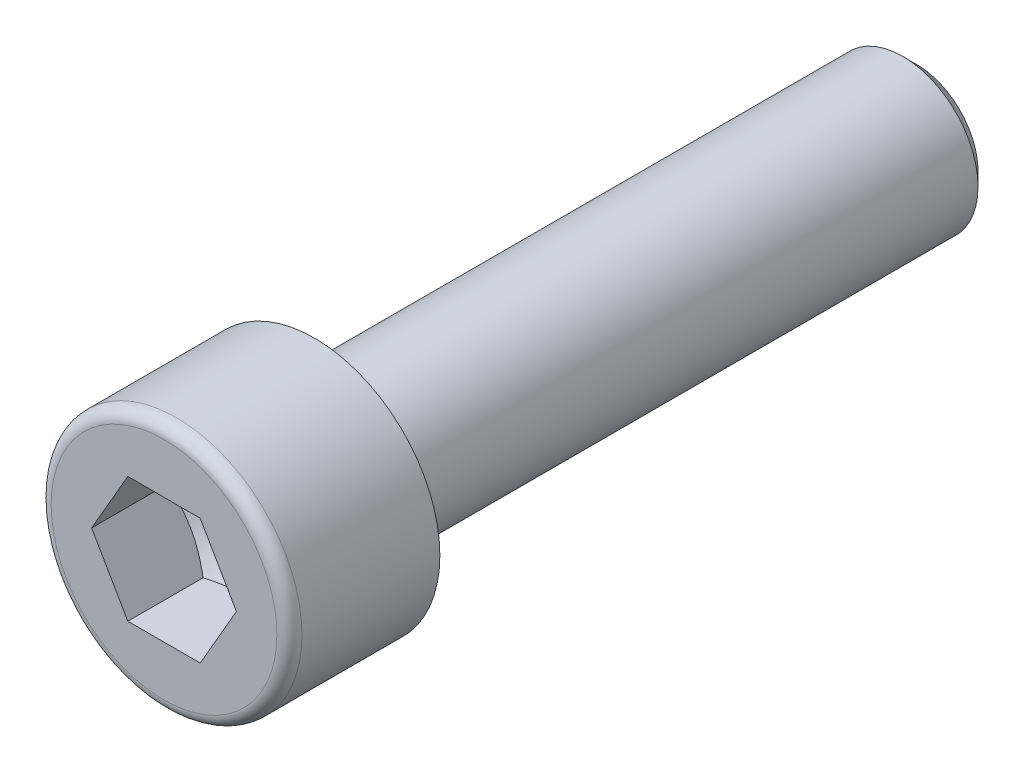
ISO-10303-21;
HEADER;
FILE_DESCRIPTION(('STEP AP214'),'2;1');
FILE_NAME('part.step','',(''),(''),'','','');
FILE_SCHEMA(('AUTOMOTIVE_DESIGN { 1 0 10303 214 1 1 1 1 }'));
ENDSEC;
DATA;
#1=APPLICATION_CONTEXT('core data for automotive mechanical design processes');
#2=APPLICATION_PROTOCOL_DEFINITION('international standard','automotive_design',2000,#1);
#3=PRODUCT_CONTEXT('',#1,'mechanical');
#4=PRODUCT('Part','Part','',(#3));
#5=PRODUCT_RELATED_PRODUCT_CATEGORY('part','',(#4));
#6=PRODUCT_DEFINITION_FORMATION('','',#4);
#7=PRODUCT_DEFINITION_CONTEXT('part definition',#1,'design');
#8=PRODUCT_DEFINITION('design','',#6,#7);
#9=PRODUCT_DEFINITION_SHAPE('','',#8);
#10=(LENGTH_UNIT() NAMED_UNIT(*) SI_UNIT(.MILLI.,.METRE.));
#11=(NAMED_UNIT(*) PLANE_ANGLE_UNIT() SI_UNIT($,.RADIAN.));
#12=(NAMED_UNIT(*) SI_UNIT($,.STERADIAN.) SOLID_ANGLE_UNIT());
#13=UNCERTAINTY_MEASURE_WITH_UNIT(LENGTH_MEASURE(1.E-05),#10,'distance_accuracy_value','');
#14=(GEOMETRIC_REPRESENTATION_CONTEXT(3) GLOBAL_UNCERTAINTY_ASSIGNED_CONTEXT((#13)) GLOBAL_UNIT_ASSIGNED_CONTEXT((#10,
#11,#12)) REPRESENTATION_CONTEXT('',''));
#15=CARTESIAN_POINT('',(0.,0.,0.));
#16=DIRECTION('',(0.,0.,1.));
#17=DIRECTION('',(1.,0.,0.));
#18=AXIS2_PLACEMENT_3D('',#15,#16,#17);
#19=CARTESIAN_POINT('',(0.,0.,0.));
#20=DIRECTION('',(0.,0.,1.));
#21=DIRECTION('',(1.,0.,0.));
#22=AXIS2_PLACEMENT_3D('',#19,#20,#21);
#23=PLANE('',#22);
#24=CARTESIAN_POINT('',(0.,0.,0.));
#25=DIRECTION('',(0.,0.,1.));
#26=DIRECTION('',(1.,0.,0.));
#27=AXIS2_PLACEMENT_3D('',#24,#25,#26);
#28=CIRCLE('',#27,5.);
#29=CARTESIAN_POINT('',(5.,0.,0.));
#30=VERTEX_POINT('',#29);
#31=EDGE_CURVE('E144',#30,#30,#28,.T.);
#32=ORIENTED_EDGE('',*,*,#31,.F.);
#33=EDGE_LOOP('',(#32));
#34=FACE_BOUND('',#33,.T.);
#35=CARTESIAN_POINT('',(0.,0.,0.));
#36=DIRECTION('',(0.,0.,1.));
#37=DIRECTION('',(1.,0.,0.));
#38=AXIS2_PLACEMENT_3D('',#35,#36,#37);
#39=CIRCLE('',#38,3.);
#40=CARTESIAN_POINT('',(3.,0.,0.));
#41=VERTEX_POINT('',#40);
#42=EDGE_CURVE('E149',#41,#41,#39,.F.);
#43=ORIENTED_EDGE('',*,*,#42,.F.);
#44=EDGE_LOOP('',(#43));
#45=FACE_BOUND('',#44,.T.);
#46=ADVANCED_FACE('F41',(#34,#45),#23,.F.);
#47=CARTESIAN_POINT('',(0.,4.5,6.));
#48=DIRECTION('',(0.,0.,-1.));
#49=DIRECTION('',(-1.,0.,0.));
#50=AXIS2_PLACEMENT_3D('',#47,#48,#49);
#51=PLANE('',#50);
#52=CARTESIAN_POINT('',(0.,0.,6.));
#53=DIRECTION('',(0.,0.,-1.));
#54=DIRECTION('',(-1.,0.,0.));
#55=AXIS2_PLACEMENT_3D('',#52,#53,#54);
#56=CIRCLE('',#55,4.5);
#57=CARTESIAN_POINT('',(-4.5,0.,6.));
#58=VERTEX_POINT('',#57);
#59=EDGE_CURVE('E49',#58,#58,#56,.F.);
#60=ORIENTED_EDGE('',*,*,#59,.T.);
#61=EDGE_LOOP('',(#60));
#62=FACE_BOUND('',#61,.T.);
#63=DIRECTION('',(0.5,-0.866025403784439,0.));
#64=VECTOR('',#63,1.);
#65=CARTESIAN_POINT('',(1.443375,2.49999883437473,6.));
#66=LINE('',#65,#64);
#67=CARTESIAN_POINT('',(1.443375,2.49999883437473,6.));
#68=VERTEX_POINT('',#67);
#69=CARTESIAN_POINT('',(2.88675,0.,6.));
#70=VERTEX_POINT('',#69);
#71=EDGE_CURVE('E56',#68,#70,#66,.T.);
#72=ORIENTED_EDGE('',*,*,#71,.T.);
#73=DIRECTION('',(-0.5,-0.866025403784439,0.));
#74=VECTOR('',#73,1.);
#75=CARTESIAN_POINT('',(2.88675,0.,6.));
#76=LINE('',#75,#74);
#77=CARTESIAN_POINT('',(1.443375,-2.49999883437473,6.));
#78=VERTEX_POINT('',#77);
#79=EDGE_CURVE('E173',#70,#78,#76,.T.);
#80=ORIENTED_EDGE('',*,*,#79,.T.);
#81=DIRECTION('',(-1.,0.,0.));
#82=VECTOR('',#81,1.);
#83=CARTESIAN_POINT('',(1.443375,-2.49999883437473,6.));
#84=LINE('',#83,#82);
#85=CARTESIAN_POINT('',(-1.443375,-2.49999883437473,6.));
#86=VERTEX_POINT('',#85);
#87=EDGE_CURVE('E269',#78,#86,#84,.T.);
#88=ORIENTED_EDGE('',*,*,#87,.T.);
#89=DIRECTION('',(-0.5,0.866025403784439,0.));
#90=VECTOR('',#89,1.);
#91=CARTESIAN_POINT('',(-1.443375,-2.49999883437473,6.));
#92=LINE('',#91,#90);
#93=CARTESIAN_POINT('',(-2.88675,0.,6.));
#94=VERTEX_POINT('',#93);
#95=EDGE_CURVE('E273',#86,#94,#92,.T.);
#96=ORIENTED_EDGE('',*,*,#95,.T.);
#97=DIRECTION('',(0.5,0.866025403784439,0.));
#98=VECTOR('',#97,1.);
#99=CARTESIAN_POINT('',(-2.88675,0.,6.));
#100=LINE('',#99,#98);
#101=CARTESIAN_POINT('',(-1.443375,2.49999883437473,6.));
#102=VERTEX_POINT('',#101);
#103=EDGE_CURVE('E128',#94,#102,#100,.T.);
#104=ORIENTED_EDGE('',*,*,#103,.T.);
#105=DIRECTION('',(1.,0.,0.));
#106=VECTOR('',#105,1.);
#107=CARTESIAN_POINT('',(-1.443375,2.49999883437473,6.));
#108=LINE('',#107,#106);
#109=EDGE_CURVE('E120',#102,#68,#108,.T.);
#110=ORIENTED_EDGE('',*,*,#109,.T.);
#111=EDGE_LOOP('',(#72,#80,#88,#96,#104,#110));
#112=FACE_BOUND('',#111,.T.);
#113=ADVANCED_FACE('F228',(#62,#112),#51,.F.);
#114=CARTESIAN_POINT('',(0.,0.,6.));
#115=DIRECTION('',(0.,0.,1.));
#116=DIRECTION('',(1.,0.,0.));
#117=AXIS2_PLACEMENT_3D('',#114,#115,#116);
#118=CYLINDRICAL_SURFACE('',#117,5.);
#119=CARTESIAN_POINT('',(0.,0.,5.5));
#120=DIRECTION('',(0.,0.,-1.));
#121=DIRECTION('',(-1.,0.,0.));
#122=AXIS2_PLACEMENT_3D('',#119,#120,#121);
#123=CIRCLE('',#122,5.);
#124=CARTESIAN_POINT('',(-5.,0.,5.5));
#125=VERTEX_POINT('',#124);
#126=EDGE_CURVE('E12',#125,#125,#123,.T.);
#127=ORIENTED_EDGE('',*,*,#126,.T.);
#128=EDGE_LOOP('',(#127));
#129=FACE_BOUND('',#128,.T.);
#130=ORIENTED_EDGE('',*,*,#31,.T.);
#131=EDGE_LOOP('',(#130));
#132=FACE_BOUND('',#131,.T.);
#133=ADVANCED_FACE('F226',(#129,#132),#118,.T.);
#134=CARTESIAN_POINT('',(1.443375,2.49999883437473,1.33333411041685));
#135=DIRECTION('',(-0.866025403784439,-0.5,0.));
#136=DIRECTION('',(-0.5,0.866025403784438,0.));
#137=AXIS2_PLACEMENT_3D('',#134,#135,#136);
#138=PLANE('',#137);
#139=DIRECTION('',(0.,0.,1.));
#140=VECTOR('',#139,1.);
#141=CARTESIAN_POINT('',(2.88675,0.,1.33333411041685));
#142=LINE('',#141,#140);
#143=CARTESIAN_POINT('',(2.88675,0.,3.));
#144=VERTEX_POINT('',#143);
#145=EDGE_CURVE('E141',#144,#70,#142,.T.);
#146=ORIENTED_EDGE('',*,*,#145,.T.);
#147=ORIENTED_EDGE('',*,*,#71,.F.);
#148=DIRECTION('',(0.,0.,1.));
#149=VECTOR('',#148,1.);
#150=CARTESIAN_POINT('',(1.443375,2.49999883437473,1.33333411041685));
#151=LINE('',#150,#149);
#152=CARTESIAN_POINT('',(1.443375,2.49999883437473,3.));
#153=VERTEX_POINT('',#152);
#154=EDGE_CURVE('E113',#153,#68,#151,.T.);
#155=ORIENTED_EDGE('',*,*,#154,.F.);
#156=CARTESIAN_POINT('',(2.88675115470054,-2.E-06,3.00000066666707));
#157=CARTESIAN_POINT('',(2.82332354535897,0.109857841982227,2.96337006039726));
#158=CARTESIAN_POINT('',(2.75934842983882,0.220665992483223,2.93005643273496));
#159=CARTESIAN_POINT('',(2.63029051087885,0.444200865240994,2.87190847700775));
#160=CARTESIAN_POINT('',(2.56520541506427,0.556931558007335,2.84709471727335));
#161=CARTESIAN_POINT('',(2.4358417909861,0.78099592756197,2.8084702850323));
#162=CARTESIAN_POINT('',(2.37158316147789,0.892295138694932,2.79440251599447));
#163=CARTESIAN_POINT('',(2.24276369983448,1.11541699126498,2.77761163079658));
#164=CARTESIAN_POINT('',(2.17820333560637,1.22723882226323,2.77487460704407));
#165=CARTESIAN_POINT('',(2.05757906871724,1.43616618114094,2.7805828840092));
#166=CARTESIAN_POINT('',(2.00149706603362,1.53330305917919,2.78762661346734));
#167=CARTESIAN_POINT('',(1.88969841687931,1.72694399973201,2.8099466525033));
#168=CARTESIAN_POINT('',(1.83398215680598,1.82344739298676,2.82523057920943));
#169=CARTESIAN_POINT('',(1.72195318911858,2.01748725694082,2.86343746342627));
#170=CARTESIAN_POINT('',(1.66565465323697,2.1149991814795,2.88652230296935));
#171=CARTESIAN_POINT('',(1.55389703460282,2.30856905508676,2.93891513912548));
#172=CARTESIAN_POINT('',(1.49843652119396,2.40462948212476,2.96821083329068));
#173=CARTESIAN_POINT('',(1.44337384529946,2.50000083437473,3.00000066666707));
#174=B_SPLINE_CURVE_WITH_KNOTS('',3,(#156,#157,#158,#159,#160,#161,#162,#163,#164,#165,#166,
#167,#168,#169,#170,#171,#172,#173),.UNSPECIFIED.,.F.,.F.,(4,2,2,2,2,2,2,2,4),(0.,
0.396269987805477,0.793492221888839,1.1808844206854,1.56780098500208,1.90463546712439,
2.24178184973835,2.58640455505215,2.93035090593904),.UNSPECIFIED.);
#175=EDGE_CURVE('E105',#144,#153,#174,.T.);
#176=ORIENTED_EDGE('',*,*,#175,.F.);
#177=EDGE_LOOP('',(#146,#147,#155,#176));
#178=FACE_BOUND('',#177,.T.);
#179=ADVANCED_FACE('F114',(#178),#138,.T.);
#180=CARTESIAN_POINT('',(2.88675,0.,1.33333411041685));
#181=DIRECTION('',(-0.866025403784439,0.5,0.));
#182=DIRECTION('',(0.5,0.866025403784439,0.));
#183=AXIS2_PLACEMENT_3D('',#180,#181,#182);
#184=PLANE('',#183);
#185=DIRECTION('',(0.,0.,1.));
#186=VECTOR('',#185,1.);
#187=CARTESIAN_POINT('',(1.443375,-2.49999883437473,1.33333411041685));
#188=LINE('',#187,#186);
#189=CARTESIAN_POINT('',(1.443375,-2.49999883437473,3.));
#190=VERTEX_POINT('',#189);
#191=EDGE_CURVE('E138',#190,#78,#188,.T.);
#192=ORIENTED_EDGE('',*,*,#191,.T.);
#193=ORIENTED_EDGE('',*,*,#79,.F.);
#194=ORIENTED_EDGE('',*,*,#145,.F.);
#195=CARTESIAN_POINT('',(1.44337384529946,-2.50000083437473,3.00000066666707));
#196=CARTESIAN_POINT('',(1.50680145464103,-2.3901409923925,2.96337006039726));
#197=CARTESIAN_POINT('',(1.57077657016118,-2.27933284189151,2.93005643273496));
#198=CARTESIAN_POINT('',(1.69983448912115,-2.05579796913373,2.87190847700775));
#199=CARTESIAN_POINT('',(1.76491958493573,-1.94306727636739,2.84709471727335));
#200=CARTESIAN_POINT('',(1.8942832090139,-1.71900290681276,2.8084702850323));
#201=CARTESIAN_POINT('',(1.95854183852211,-1.6077036956798,2.79440251599447));
#202=CARTESIAN_POINT('',(2.08736130016552,-1.38458184310974,2.77761163079658));
#203=CARTESIAN_POINT('',(2.15192166439363,-1.2727600121115,2.77487460704408));
#204=CARTESIAN_POINT('',(2.27254593128276,-1.06383265323379,2.7805828840092));
#205=CARTESIAN_POINT('',(2.32862793396638,-0.966695775195541,2.78762661346734));
#206=CARTESIAN_POINT('',(2.44042658312069,-0.773054834642715,2.8099466525033));
#207=CARTESIAN_POINT('',(2.49614284319403,-0.676551441387972,2.82523057920943));
#208=CARTESIAN_POINT('',(2.60817181088142,-0.482511577433911,2.86343746342627));
#209=CARTESIAN_POINT('',(2.66447034676303,-0.384999652895224,2.88652230296935));
#210=CARTESIAN_POINT('',(2.77622796539718,-0.191429779287974,2.93891513912548));
#211=CARTESIAN_POINT('',(2.83168847880604,-0.0953693522499732,2.96821083329068));
#212=CARTESIAN_POINT('',(2.88675115470054,2.00000000025213E-06,3.00000066666707));
#213=B_SPLINE_CURVE_WITH_KNOTS('',3,(#195,#196,#197,#198,#199,#200,#201,#202,#203,#204,#205,
#206,#207,#208,#209,#210,#211,#212),.UNSPECIFIED.,.F.,.F.,(4,2,2,2,2,2,2,2,4),(0.,
0.396269987805478,0.79349222188884,1.1808844206854,1.56780098500208,1.90463546712439,
2.24178184973836,2.58640455505215,2.93035090593904),.UNSPECIFIED.);
#214=EDGE_CURVE('E109',#190,#144,#213,.T.);
#215=ORIENTED_EDGE('',*,*,#214,.F.);
#216=EDGE_LOOP('',(#192,#193,#194,#215));
#217=FACE_BOUND('',#216,.T.);
#218=ADVANCED_FACE('F217',(#217),#184,.T.);
#219=CARTESIAN_POINT('',(1.443375,-2.49999883437473,1.33333411041685));
#220=DIRECTION('',(0.,1.,0.));
#221=DIRECTION('',(1.,0.,0.));
#222=AXIS2_PLACEMENT_3D('',#219,#220,#221);
#223=PLANE('',#222);
#224=DIRECTION('',(0.,0.,1.));
#225=VECTOR('',#224,1.);
#226=CARTESIAN_POINT('',(-1.443375,-2.49999883437473,1.33333411041685));
#227=LINE('',#226,#225);
#228=CARTESIAN_POINT('',(-1.443375,-2.49999883437473,3.));
#229=VERTEX_POINT('',#228);
#230=EDGE_CURVE('E135',#229,#86,#227,.T.);
#231=ORIENTED_EDGE('',*,*,#230,.T.);
#232=ORIENTED_EDGE('',*,*,#87,.F.);
#233=ORIENTED_EDGE('',*,*,#191,.F.);
#234=CARTESIAN_POINT('',(-3.73786106214979,-2.49999883437473,3.92958778907324));
#235=CARTESIAN_POINT('',(-3.62990250335969,-2.49999883437473,3.87779335774325));
#236=CARTESIAN_POINT('',(-3.52168094276801,-2.49999883437473,3.82653690477121));
#237=CARTESIAN_POINT('',(-3.30457164494513,-2.49999883437473,3.72540514162743));
#238=CARTESIAN_POINT('',(-3.19568379207403,-2.49999883437473,3.67553008001432));
#239=CARTESIAN_POINT('',(-2.9764774054262,-2.49999883437473,3.57718765766728));
#240=CARTESIAN_POINT('',(-2.86615419981139,-2.49999883437473,3.52873067133896));
#241=CARTESIAN_POINT('',(-2.64458202847932,-2.49999883437473,3.4339896311619));
#242=CARTESIAN_POINT('',(-2.53333311125245,-2.49999883437473,3.38770546433014));
#243=CARTESIAN_POINT('',(-2.30680205819545,-2.49999883437473,3.2967100755852));
#244=CARTESIAN_POINT('',(-2.19149052050016,-2.49999883437473,3.2520716190807));
#245=CARTESIAN_POINT('',(-1.95947266398433,-2.49999883437473,3.1665059843482));
#246=CARTESIAN_POINT('',(-1.84276618516189,-2.49999883437473,3.12557923657333));
#247=CARTESIAN_POINT('',(-1.60804233924781,-2.49999883437473,3.04860739009266));
#248=CARTESIAN_POINT('',(-1.49002871456052,-2.49999883437473,3.01255100191558));
#249=CARTESIAN_POINT('',(-1.25231014409633,-2.49999883437473,2.94655294839667));
#250=CARTESIAN_POINT('',(-1.13260562628878,-2.49999883437473,2.91660976441946));
#251=CARTESIAN_POINT('',(-0.891754624847682,-2.49999883437473,2.86443431611274));
#252=CARTESIAN_POINT('',(-0.770611640017906,-2.49999883437473,2.84218621451804));
#253=CARTESIAN_POINT('',(-0.526970339246118,-2.49999883437473,2.8068577746921));
#254=CARTESIAN_POINT('',(-0.404472115461951,-2.49999883437473,2.79377681692952));
#255=CARTESIAN_POINT('',(-0.160266323051493,-2.49999883437473,2.7779963214066));
#256=CARTESIAN_POINT('',(-0.0385668667227562,-2.49999883437473,2.77517427588141));
#257=CARTESIAN_POINT('',(0.204641816788917,-2.49999883437473,2.77983589012324));
#258=CARTESIAN_POINT('',(0.326151031726512,-2.49999883437473,2.78732018801759));
#259=CARTESIAN_POINT('',(0.536550258909014,-2.49999883437473,2.80869871352845));
#260=CARTESIAN_POINT('',(0.62567290534766,-2.49999883437473,2.82040889034712));
#261=CARTESIAN_POINT('',(0.80317291802574,-2.49999883437473,2.84856827951529));
#262=CARTESIAN_POINT('',(0.89155015258231,-2.49999883437473,2.86501831186796));
#263=CARTESIAN_POINT('',(1.15551819105506,-2.49999883437473,2.920608175745));
#264=CARTESIAN_POINT('',(1.32980784141715,-2.49999883437473,2.96597208143992));
#265=CARTESIAN_POINT('',(1.59042319619559,-2.49999883437473,3.04347409361569));
#266=CARTESIAN_POINT('',(1.6781227038712,-2.49999883437473,3.07124565241289));
#267=CARTESIAN_POINT('',(1.85261386594625,-2.49999883437473,3.12935698644029));
#268=CARTESIAN_POINT('',(1.93940604944137,-2.49999883437473,3.15969515890171));
#269=CARTESIAN_POINT('',(2.11219208096506,-2.49999883437473,3.2225001255257));
#270=CARTESIAN_POINT('',(2.19818607085344,-2.49999883437473,3.25496653284332));
#271=CARTESIAN_POINT('',(2.36949689943691,-2.49999883437473,3.32167630023758));
#272=CARTESIAN_POINT('',(2.4548136208992,-2.49999883437473,3.35591996053755));
#273=CARTESIAN_POINT('',(2.6725866434786,-2.49999883437473,3.44552247380957));
#274=CARTESIAN_POINT('',(2.80460719164756,-2.49999883437473,3.50193903020824));
#275=CARTESIAN_POINT('',(3.06745887456859,-2.49999883437473,3.61748626069377));
#276=CARTESIAN_POINT('',(3.19828991933625,-2.49999883437473,3.6766171381022));
#277=CARTESIAN_POINT('',(3.4590085358823,-2.49999883437473,3.79697662160321));
#278=CARTESIAN_POINT('',(3.58889593921384,-2.49999883437473,3.85820559158554));
#279=CARTESIAN_POINT('',(3.84788850349047,-2.49999883437473,3.98229871528446));
#280=CARTESIAN_POINT('',(3.97699364696087,-2.49999883437473,4.04516290536492));
#281=CARTESIAN_POINT('',(4.36366797006391,-2.49999883437473,4.23583166126771));
#282=CARTESIAN_POINT('',(4.62028446759073,-2.49999883437473,4.36556642178983));
#283=CARTESIAN_POINT('',(5.13176042686128,-2.49999883437473,4.62835386929467));
#284=CARTESIAN_POINT('',(5.38662010673858,-2.49999883437473,4.76140613453321));
#285=CARTESIAN_POINT('',(5.87112459117811,-2.49999883437473,5.01714634418064));
#286=CARTESIAN_POINT('',(6.10087887005075,-2.49999883437473,5.13962722061171));
#287=CARTESIAN_POINT('',(6.55964844430519,-2.49999883437473,5.38598343470431));
#288=CARTESIAN_POINT('',(6.78866371193351,-2.49999883437473,5.50985882397014));
#289=CARTESIAN_POINT('',(7.2455430452267,-2.49999883437473,5.75833902928913));
#290=CARTESIAN_POINT('',(7.47340855738404,-2.49999883437473,5.88294118863516));
#291=CARTESIAN_POINT('',(7.9286788902648,-2.49999883437473,6.13295649095833));
#292=CARTESIAN_POINT('',(8.156083734473,-2.49999883437473,6.25836959115399));
#293=CARTESIAN_POINT('',(8.38332307978598,-2.49999883437473,6.38407993098458));
#294=B_SPLINE_CURVE_WITH_KNOTS('',3,(#234,#235,#236,#237,#238,#239,#240,#241,#242,#243,#244,
#245,#246,#247,#248,#249,#250,#251,#252,#253,#254,#255,#256,#257,#258,#259,#260,#261,#262,#263,
#264,#265,#266,#267,#268,#269,#270,#271,#272,#273,#274,#275,#276,#277,#278,#279,#280,#281,#282,
#283,#284,#285,#286,#287,#288,#289,#290,#291,#292,#293),.UNSPECIFIED.,.F.,.F.,(4,2,2,2,2,2,2,2,
2,2,2,2,2,2,2,2,2,2,2,2,2,2,2,2,2,2,2,2,2,4),(0.,0.359225681612437,0.718515585501186,
1.07998495471943,1.44143550726446,1.81233642992121,2.18328031172541,2.553349025072,
2.92332569419794,3.29253631826214,3.66172198803058,4.02648423639168,4.39126907037958,
4.66080188357842,4.93038135444365,5.4699536049164,5.74590907322745,6.02169347043866,
6.29742787713709,6.57320901498075,7.00387400010299,7.43457129784687,7.86534367692857,
8.29612564369277,9.15872160396268,10.0212084586034,10.8022892260896,11.5833989933082,
12.3625220011586,13.1416042361018),.UNSPECIFIED.);
#295=EDGE_CURVE('E206',#229,#190,#294,.T.);
#296=ORIENTED_EDGE('',*,*,#295,.F.);
#297=EDGE_LOOP('',(#231,#232,#233,#296));
#298=FACE_BOUND('',#297,.T.);
#299=ADVANCED_FACE('F213',(#298),#223,.T.);
#300=CARTESIAN_POINT('',(-1.443375,-2.49999883437473,1.33333411041685));
#301=DIRECTION('',(0.866025403784439,0.5,0.));
#302=DIRECTION('',(0.5,-0.866025403784439,0.));
#303=AXIS2_PLACEMENT_3D('',#300,#301,#302);
#304=PLANE('',#303);
#305=DIRECTION('',(0.,0.,1.));
#306=VECTOR('',#305,1.);
#307=CARTESIAN_POINT('',(-2.88675,0.,1.33333411041685));
#308=LINE('',#307,#306);
#309=CARTESIAN_POINT('',(-2.88675,0.,3.));
#310=VERTEX_POINT('',#309);
#311=EDGE_CURVE('E126',#310,#94,#308,.T.);
#312=ORIENTED_EDGE('',*,*,#311,.T.);
#313=ORIENTED_EDGE('',*,*,#95,.F.);
#314=ORIENTED_EDGE('',*,*,#230,.F.);
#315=CARTESIAN_POINT('',(-2.88675115470054,2.00000000083267E-06,3.00000066666707));
#316=CARTESIAN_POINT('',(-2.82332354535897,-0.109857841982226,2.96337006039727));
#317=CARTESIAN_POINT('',(-2.75934842983882,-0.220665992483222,2.93005643273496));
#318=CARTESIAN_POINT('',(-2.63029051087885,-0.444200865240993,2.87190847700775));
#319=CARTESIAN_POINT('',(-2.56520541506427,-0.556931558007334,2.84709471727335));
#320=CARTESIAN_POINT('',(-2.4358417909861,-0.780995927561968,2.8084702850323));
#321=CARTESIAN_POINT('',(-2.37158316147789,-0.89229513869493,2.79440251599447));
#322=CARTESIAN_POINT('',(-2.24276369983448,-1.11541699126498,2.77761163079658));
#323=CARTESIAN_POINT('',(-2.17820333560637,-1.22723882226323,2.77487460704408));
#324=CARTESIAN_POINT('',(-2.05757906871724,-1.43616618114094,2.7805828840092));
#325=CARTESIAN_POINT('',(-2.00149706603362,-1.53330305917919,2.78762661346734));
#326=CARTESIAN_POINT('',(-1.88969841687931,-1.72694399973201,2.8099466525033));
#327=CARTESIAN_POINT('',(-1.83398215680598,-1.82344739298676,2.82523057920943));
#328=CARTESIAN_POINT('',(-1.72195318911858,-2.01748725694082,2.86343746342627));
#329=CARTESIAN_POINT('',(-1.66565465323697,-2.1149991814795,2.88652230296935));
#330=CARTESIAN_POINT('',(-1.55389703460282,-2.30856905508676,2.93891513912548));
#331=CARTESIAN_POINT('',(-1.49843652119396,-2.40462948212476,2.96821083329068));
#332=CARTESIAN_POINT('',(-1.44337384529946,-2.50000083437473,3.00000066666707));
#333=B_SPLINE_CURVE_WITH_KNOTS('',3,(#315,#316,#317,#318,#319,#320,#321,#322,#323,#324,#325,
#326,#327,#328,#329,#330,#331,#332),.UNSPECIFIED.,.F.,.F.,(4,2,2,2,2,2,2,2,4),(0.,
0.396269987805478,0.793492221888839,1.1808844206854,1.56780098500208,1.90463546712439,
2.24178184973836,2.58640455505215,2.93035090593905),.UNSPECIFIED.);
#334=EDGE_CURVE('E200',#310,#229,#333,.T.);
#335=ORIENTED_EDGE('',*,*,#334,.F.);
#336=EDGE_LOOP('',(#312,#313,#314,#335));
#337=FACE_BOUND('',#336,.T.);
#338=ADVANCED_FACE('F216',(#337),#304,.T.);
#339=CARTESIAN_POINT('',(-2.88675,0.,1.33333411041685));
#340=DIRECTION('',(0.866025403784439,-0.5,0.));
#341=DIRECTION('',(-0.5,-0.866025403784439,0.));
#342=AXIS2_PLACEMENT_3D('',#339,#340,#341);
#343=PLANE('',#342);
#344=DIRECTION('',(0.,0.,1.));
#345=VECTOR('',#344,1.);
#346=CARTESIAN_POINT('',(-1.443375,2.49999883437473,1.33333411041685));
#347=LINE('',#346,#345);
#348=CARTESIAN_POINT('',(-1.443375,2.49999883437473,3.));
#349=VERTEX_POINT('',#348);
#350=EDGE_CURVE('E119',#349,#102,#347,.T.);
#351=ORIENTED_EDGE('',*,*,#350,.T.);
#352=ORIENTED_EDGE('',*,*,#103,.F.);
#353=ORIENTED_EDGE('',*,*,#311,.F.);
#354=CARTESIAN_POINT('',(-1.44337384529946,2.50000083437473,3.00000066666707));
#355=CARTESIAN_POINT('',(-1.50680145464103,2.3901409923925,2.96337006039726));
#356=CARTESIAN_POINT('',(-1.57077657016118,2.27933284189151,2.93005643273496));
#357=CARTESIAN_POINT('',(-1.69983448912115,2.05579796913373,2.87190847700775));
#358=CARTESIAN_POINT('',(-1.76491958493573,1.94306727636739,2.84709471727335));
#359=CARTESIAN_POINT('',(-1.8942832090139,1.71900290681276,2.8084702850323));
#360=CARTESIAN_POINT('',(-1.95854183852211,1.6077036956798,2.79440251599447));
#361=CARTESIAN_POINT('',(-2.08736130016552,1.38458184310974,2.77761163079658));
#362=CARTESIAN_POINT('',(-2.15192166439363,1.2727600121115,2.77487460704408));
#363=CARTESIAN_POINT('',(-2.27254593128276,1.06383265323379,2.7805828840092));
#364=CARTESIAN_POINT('',(-2.32862793396638,0.966695775195541,2.78762661346734));
#365=CARTESIAN_POINT('',(-2.44042658312069,0.773054834642715,2.8099466525033));
#366=CARTESIAN_POINT('',(-2.49614284319402,0.676551441387972,2.82523057920943));
#367=CARTESIAN_POINT('',(-2.60817181088142,0.482511577433911,2.86343746342627));
#368=CARTESIAN_POINT('',(-2.66447034676303,0.384999652895224,2.88652230296935));
#369=CARTESIAN_POINT('',(-2.77622796539718,0.191429779287974,2.93891513912548));
#370=CARTESIAN_POINT('',(-2.83168847880604,0.0953693522499737,2.96821083329068));
#371=CARTESIAN_POINT('',(-2.88675115470054,-1.9999999995853E-06,3.00000066666707));
#372=B_SPLINE_CURVE_WITH_KNOTS('',3,(#354,#355,#356,#357,#358,#359,#360,#361,#362,#363,#364,
#365,#366,#367,#368,#369,#370,#371),.UNSPECIFIED.,.F.,.F.,(4,2,2,2,2,2,2,2,4),(0.,
0.396269987805478,0.79349222188884,1.1808844206854,1.56780098500208,1.90463546712439,
2.24178184973835,2.58640455505215,2.93035090593904),.UNSPECIFIED.);
#373=EDGE_CURVE('E64',#349,#310,#372,.T.);
#374=ORIENTED_EDGE('',*,*,#373,.F.);
#375=EDGE_LOOP('',(#351,#352,#353,#374));
#376=FACE_BOUND('',#375,.T.);
#377=ADVANCED_FACE('F295',(#376),#343,.T.);
#378=CARTESIAN_POINT('',(-1.443375,2.49999883437473,1.33333411041685));
#379=DIRECTION('',(0.,-1.,0.));
#380=DIRECTION('',(-1.,0.,0.));
#381=AXIS2_PLACEMENT_3D('',#378,#379,#380);
#382=PLANE('',#381);
#383=ORIENTED_EDGE('',*,*,#154,.T.);
#384=ORIENTED_EDGE('',*,*,#109,.F.);
#385=ORIENTED_EDGE('',*,*,#350,.F.);
#386=CARTESIAN_POINT('',(-3.73786106214979,2.49999883437473,3.92958778907324));
#387=CARTESIAN_POINT('',(-3.62990250335969,2.49999883437473,3.87779335774325));
#388=CARTESIAN_POINT('',(-3.52168094276801,2.49999883437473,3.82653690477121));
#389=CARTESIAN_POINT('',(-3.30457164494513,2.49999883437473,3.72540514162743));
#390=CARTESIAN_POINT('',(-3.19568379207404,2.49999883437473,3.67553008001432));
#391=CARTESIAN_POINT('',(-2.9764774054262,2.49999883437473,3.57718765766728));
#392=CARTESIAN_POINT('',(-2.86615419981139,2.49999883437473,3.52873067133896));
#393=CARTESIAN_POINT('',(-2.64458202847932,2.49999883437473,3.4339896311619));
#394=CARTESIAN_POINT('',(-2.53333311125245,2.49999883437473,3.38770546433014));
#395=CARTESIAN_POINT('',(-2.30680205819545,2.49999883437473,3.2967100755852));
#396=CARTESIAN_POINT('',(-2.19149052050016,2.49999883437473,3.2520716190807));
#397=CARTESIAN_POINT('',(-1.95947266398433,2.49999883437473,3.1665059843482));
#398=CARTESIAN_POINT('',(-1.8427661851619,2.49999883437473,3.12557923657333));
#399=CARTESIAN_POINT('',(-1.60804233924781,2.49999883437473,3.04860739009266));
#400=CARTESIAN_POINT('',(-1.49002871456052,2.49999883437473,3.01255100191558));
#401=CARTESIAN_POINT('',(-1.25231014409633,2.49999883437473,2.94655294839667));
#402=CARTESIAN_POINT('',(-1.13260562628879,2.49999883437473,2.91660976441946));
#403=CARTESIAN_POINT('',(-0.891754624847686,2.49999883437473,2.86443431611274));
#404=CARTESIAN_POINT('',(-0.770611640017909,2.49999883437473,2.84218621451804));
#405=CARTESIAN_POINT('',(-0.526970339246121,2.49999883437473,2.8068577746921));
#406=CARTESIAN_POINT('',(-0.404472115461954,2.49999883437473,2.79377681692952));
#407=CARTESIAN_POINT('',(-0.160266323051496,2.49999883437473,2.7779963214066));
#408=CARTESIAN_POINT('',(-0.0385668667227587,2.49999883437473,2.77517427588141));
#409=CARTESIAN_POINT('',(0.204641816788915,2.49999883437473,2.77983589012324));
#410=CARTESIAN_POINT('',(0.326151031726511,2.49999883437473,2.78732018801759));
#411=CARTESIAN_POINT('',(0.536550258909011,2.49999883437473,2.80869871352845));
#412=CARTESIAN_POINT('',(0.625672905347658,2.49999883437473,2.82040889034712));
#413=CARTESIAN_POINT('',(0.803172918025738,2.49999883437473,2.84856827951529));
#414=CARTESIAN_POINT('',(0.891550152582308,2.49999883437473,2.86501831186796));
#415=CARTESIAN_POINT('',(1.15551819105505,2.49999883437473,2.920608175745));
#416=CARTESIAN_POINT('',(1.32980784141715,2.49999883437473,2.96597208143992));
#417=CARTESIAN_POINT('',(1.59042319619558,2.49999883437473,3.04347409361569));
#418=CARTESIAN_POINT('',(1.6781227038712,2.49999883437473,3.07124565241289));
#419=CARTESIAN_POINT('',(1.85261386594624,2.49999883437473,3.12935698644029));
#420=CARTESIAN_POINT('',(1.93940604944136,2.49999883437473,3.15969515890171));
#421=CARTESIAN_POINT('',(2.11219208096505,2.49999883437473,3.2225001255257));
#422=CARTESIAN_POINT('',(2.19818607085344,2.49999883437473,3.25496653284332));
#423=CARTESIAN_POINT('',(2.36949689943691,2.49999883437473,3.32167630023758));
#424=CARTESIAN_POINT('',(2.45481362089919,2.49999883437473,3.35591996053755));
#425=CARTESIAN_POINT('',(2.6725866434786,2.49999883437473,3.44552247380957));
#426=CARTESIAN_POINT('',(2.80460719164756,2.49999883437473,3.50193903020824));
#427=CARTESIAN_POINT('',(3.06745887456859,2.49999883437473,3.61748626069377));
#428=CARTESIAN_POINT('',(3.19828991933624,2.49999883437473,3.6766171381022));
#429=CARTESIAN_POINT('',(3.45900853588229,2.49999883437473,3.79697662160321));
#430=CARTESIAN_POINT('',(3.58889593921384,2.49999883437473,3.85820559158554));
#431=CARTESIAN_POINT('',(3.84788850349046,2.49999883437473,3.98229871528446));
#432=CARTESIAN_POINT('',(3.97699364696087,2.49999883437473,4.04516290536492));
#433=CARTESIAN_POINT('',(4.3636679700639,2.49999883437473,4.23583166126771));
#434=CARTESIAN_POINT('',(4.62028446759072,2.49999883437473,4.36556642178983));
#435=CARTESIAN_POINT('',(5.13176042686127,2.49999883437473,4.62835386929467));
#436=CARTESIAN_POINT('',(5.38662010673857,2.49999883437473,4.7614061345332));
#437=CARTESIAN_POINT('',(5.8711245911781,2.49999883437473,5.01714634418064));
#438=CARTESIAN_POINT('',(6.10087887005074,2.49999883437473,5.13962722061171));
#439=CARTESIAN_POINT('',(6.55964844430518,2.49999883437473,5.38598343470431));
#440=CARTESIAN_POINT('',(6.7886637119335,2.49999883437473,5.50985882397013));
#441=CARTESIAN_POINT('',(7.24554304522669,2.49999883437473,5.75833902928913));
#442=CARTESIAN_POINT('',(7.47340855738403,2.49999883437474,5.88294118863516));
#443=CARTESIAN_POINT('',(7.92867889026479,2.49999883437474,6.13295649095833));
#444=CARTESIAN_POINT('',(8.15608373447299,2.49999883437474,6.25836959115399));
#445=CARTESIAN_POINT('',(8.38332307978597,2.49999883437473,6.38407993098458));
#446=B_SPLINE_CURVE_WITH_KNOTS('',3,(#386,#387,#388,#389,#390,#391,#392,#393,#394,#395,#396,
#397,#398,#399,#400,#401,#402,#403,#404,#405,#406,#407,#408,#409,#410,#411,#412,#413,#414,#415,
#416,#417,#418,#419,#420,#421,#422,#423,#424,#425,#426,#427,#428,#429,#430,#431,#432,#433,#434,
#435,#436,#437,#438,#439,#440,#441,#442,#443,#444,#445),.UNSPECIFIED.,.F.,.F.,(4,2,2,2,2,2,2,2,
2,2,2,2,2,2,2,2,2,2,2,2,2,2,2,2,2,2,2,2,2,4),(0.,0.359225681612436,0.718515585501185,
1.07998495471943,1.44143550726446,1.8123364299212,2.1832803117254,2.553349025072,
2.92332569419794,3.29253631826213,3.66172198803058,4.02648423639168,4.39126907037958,
4.66080188357842,4.93038135444365,5.4699536049164,5.74590907322745,6.02169347043866,
6.29742787713709,6.57320901498075,7.00387400010299,7.43457129784686,7.86534367692857,
8.29612564369276,9.15872160396267,10.0212084586034,10.8022892260895,11.5833989933082,
12.3625220011586,13.1416042361018),.UNSPECIFIED.);
#447=EDGE_CURVE('E106',#153,#349,#446,.F.);
#448=ORIENTED_EDGE('',*,*,#447,.F.);
#449=EDGE_LOOP('',(#383,#384,#385,#448));
#450=FACE_BOUND('',#449,.T.);
#451=ADVANCED_FACE('F101',(#450),#382,.T.);
#452=CARTESIAN_POINT('',(0.,0.,1.33333411041685));
#453=DIRECTION('',(0.,0.,1.));
#454=DIRECTION('',(1.,0.,0.));
#455=AXIS2_PLACEMENT_3D('',#452,#453,#454);
#456=CONICAL_SURFACE('',#455,0.,1.0471975511966);
#457=CARTESIAN_POINT('',(0.,0.,1.33333411041685));
#458=VERTEX_POINT('',#457);
#459=VERTEX_LOOP('',#458);
#460=FACE_BOUND('',#459,.T.);
#461=ORIENTED_EDGE('',*,*,#175,.T.);
#462=ORIENTED_EDGE('',*,*,#447,.T.);
#463=ORIENTED_EDGE('',*,*,#373,.T.);
#464=ORIENTED_EDGE('',*,*,#334,.T.);
#465=ORIENTED_EDGE('',*,*,#295,.T.);
#466=ORIENTED_EDGE('',*,*,#214,.T.);
#467=EDGE_LOOP('',(#461,#462,#463,#464,#465,#466));
#468=FACE_BOUND('',#467,.T.);
#469=ADVANCED_FACE('F97',(#460,#468),#456,.F.);
#470=CARTESIAN_POINT('',(0.,0.,-24.));
#471=DIRECTION('',(0.,0.,1.));
#472=DIRECTION('',(1.,0.,0.));
#473=AXIS2_PLACEMENT_3D('',#470,#471,#472);
#474=CYLINDRICAL_SURFACE('',#473,3.);
#475=CARTESIAN_POINT('',(0.,0.,-23.45875));
#476=DIRECTION('',(0.,0.,-1.));
#477=DIRECTION('',(-1.,0.,0.));
#478=AXIS2_PLACEMENT_3D('',#475,#476,#477);
#479=CIRCLE('',#478,3.);
#480=CARTESIAN_POINT('',(-3.,0.,-23.45875));
#481=VERTEX_POINT('',#480);
#482=EDGE_CURVE('E251',#481,#481,#479,.F.);
#483=ORIENTED_EDGE('',*,*,#482,.T.);
#484=EDGE_LOOP('',(#483));
#485=FACE_BOUND('',#484,.T.);
#486=ORIENTED_EDGE('',*,*,#42,.T.);
#487=EDGE_LOOP('',(#486));
#488=FACE_BOUND('',#487,.T.);
#489=ADVANCED_FACE('F100',(#485,#488),#474,.T.);
#490=CARTESIAN_POINT('',(0.,0.,-24.));
#491=DIRECTION('',(0.,0.,-1.));
#492=DIRECTION('',(-1.,0.,0.));
#493=AXIS2_PLACEMENT_3D('',#490,#491,#492);
#494=PLANE('',#493);
#495=CARTESIAN_POINT('',(0.,0.,-24.));
#496=DIRECTION('',(0.,0.,-1.));
#497=DIRECTION('',(-1.,0.,0.));
#498=AXIS2_PLACEMENT_3D('',#495,#496,#497);
#499=CIRCLE('',#498,2.45875);
#500=CARTESIAN_POINT('',(-2.45875,0.,-24.));
#501=VERTEX_POINT('',#500);
#502=EDGE_CURVE('E254',#501,#501,#499,.T.);
#503=ORIENTED_EDGE('',*,*,#502,.T.);
#504=EDGE_LOOP('',(#503));
#505=FACE_BOUND('',#504,.T.);
#506=ADVANCED_FACE('F240',(#505),#494,.T.);
#507=CARTESIAN_POINT('',(0.,0.,-24.));
#508=DIRECTION('',(0.,0.,1.));
#509=DIRECTION('',(1.,0.,0.));
#510=AXIS2_PLACEMENT_3D('',#507,#508,#509);
#511=CONICAL_SURFACE('',#510,2.45875,0.78539816339744);
#512=ORIENTED_EDGE('',*,*,#482,.F.);
#513=EDGE_LOOP('',(#512));
#514=FACE_BOUND('',#513,.T.);
#515=ORIENTED_EDGE('',*,*,#502,.F.);
#516=EDGE_LOOP('',(#515));
#517=FACE_BOUND('',#516,.T.);
#518=ADVANCED_FACE('F238',(#514,#517),#511,.T.);
#519=CARTESIAN_POINT('',(0.,0.,5.5));
#520=DIRECTION('',(0.,0.,-1.));
#521=DIRECTION('',(-1.,0.,0.));
#522=AXIS2_PLACEMENT_3D('',#519,#520,#521);
#523=TOROIDAL_SURFACE('',#522,4.5,0.5);
#524=ORIENTED_EDGE('',*,*,#126,.F.);
#525=EDGE_LOOP('',(#524));
#526=FACE_BOUND('',#525,.T.);
#527=ORIENTED_EDGE('',*,*,#59,.F.);
#528=EDGE_LOOP('',(#527));
#529=FACE_BOUND('',#528,.T.);
#530=ADVANCED_FACE('F43',(#526,#529),#523,.T.);
#531=CLOSED_SHELL('',(#46,#113,#133,#179,#218,#299,#338,#377,#451,#469,#489,#506,#518,#530));
#532=MANIFOLD_SOLID_BREP('B2',#531);
#533=ADVANCED_BREP_SHAPE_REPRESENTATION('',(#18,#532),#14);
#534=SHAPE_DEFINITION_REPRESENTATION(#9,#533);
ENDSEC;
END-ISO-10303-21;
